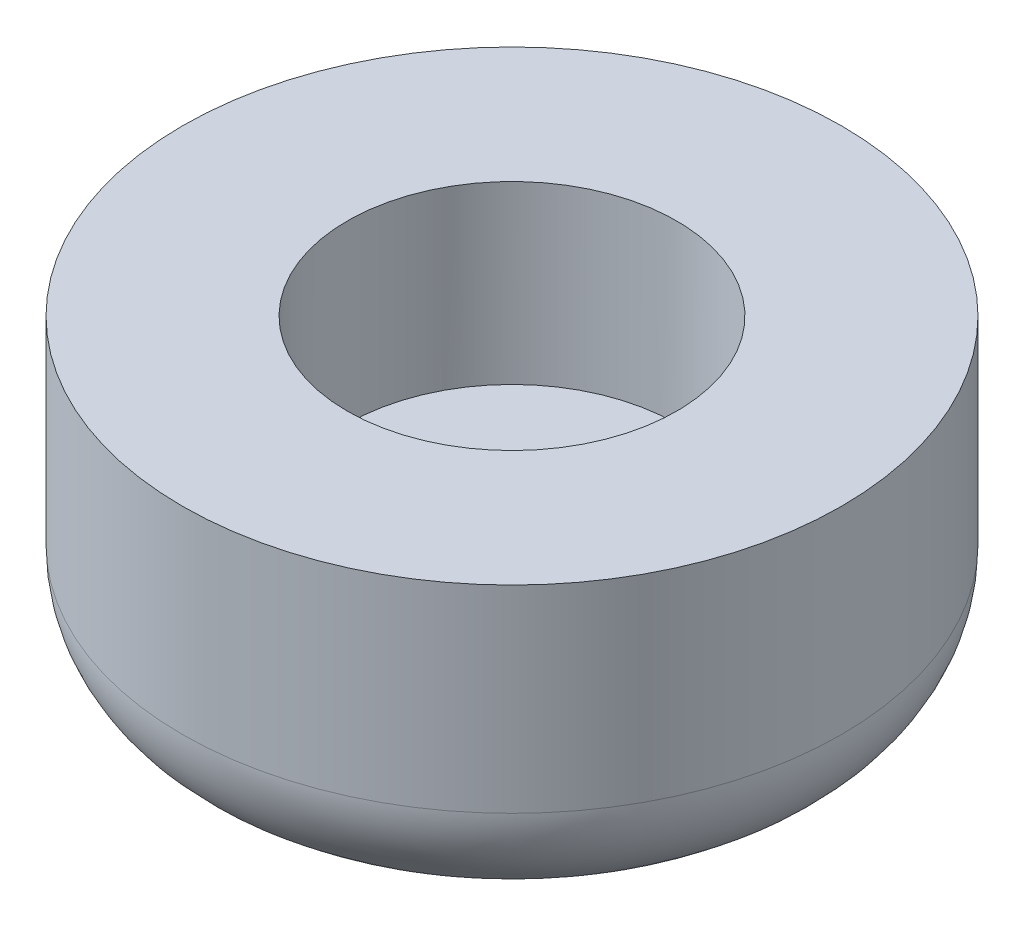
ISO-10303-21;
HEADER;
FILE_DESCRIPTION(('STEP AP214'),'2;1');
FILE_NAME('part.step','',(''),(''),'','','');
FILE_SCHEMA(('AUTOMOTIVE_DESIGN { 1 0 10303 214 1 1 1 1 }'));
ENDSEC;
DATA;
#1=APPLICATION_CONTEXT('core data for automotive mechanical design processes');
#2=APPLICATION_PROTOCOL_DEFINITION('international standard','automotive_design',2000,#1);
#3=PRODUCT_CONTEXT('',#1,'mechanical');
#4=PRODUCT('Part','Part','',(#3));
#5=PRODUCT_RELATED_PRODUCT_CATEGORY('part','',(#4));
#6=PRODUCT_DEFINITION_FORMATION('','',#4);
#7=PRODUCT_DEFINITION_CONTEXT('part definition',#1,'design');
#8=PRODUCT_DEFINITION('design','',#6,#7);
#9=PRODUCT_DEFINITION_SHAPE('','',#8);
#10=(LENGTH_UNIT() NAMED_UNIT(*) SI_UNIT(.MILLI.,.METRE.));
#11=(NAMED_UNIT(*) PLANE_ANGLE_UNIT() SI_UNIT($,.RADIAN.));
#12=(NAMED_UNIT(*) SI_UNIT($,.STERADIAN.) SOLID_ANGLE_UNIT());
#13=UNCERTAINTY_MEASURE_WITH_UNIT(LENGTH_MEASURE(1.E-05),#10,'distance_accuracy_value','');
#14=(GEOMETRIC_REPRESENTATION_CONTEXT(3) GLOBAL_UNCERTAINTY_ASSIGNED_CONTEXT((#13)) GLOBAL_UNIT_ASSIGNED_CONTEXT((#10,
#11,#12)) REPRESENTATION_CONTEXT('',''));
#15=CARTESIAN_POINT('',(0.,0.,0.));
#16=DIRECTION('',(0.,0.,1.));
#17=DIRECTION('',(1.,0.,0.));
#18=AXIS2_PLACEMENT_3D('',#15,#16,#17);
#19=CARTESIAN_POINT('',(0.,-7.,0.));
#20=DIRECTION('',(0.,1.,0.));
#21=DIRECTION('',(0.,0.,1.));
#22=AXIS2_PLACEMENT_3D('',#19,#20,#21);
#23=CYLINDRICAL_SURFACE('',#22,3.75);
#24=CARTESIAN_POINT('',(0.,0.,0.));
#25=DIRECTION('',(0.,1.,0.));
#26=DIRECTION('',(0.,0.,1.));
#27=AXIS2_PLACEMENT_3D('',#24,#25,#26);
#28=CIRCLE('',#27,3.75);
#29=CARTESIAN_POINT('',(0.,0.,3.75));
#30=VERTEX_POINT('',#29);
#31=EDGE_CURVE('E59',#30,#30,#28,.T.);
#32=ORIENTED_EDGE('',*,*,#31,.T.);
#33=EDGE_LOOP('',(#32));
#34=FACE_BOUND('',#33,.T.);
#35=CARTESIAN_POINT('',(0.,-4.,0.));
#36=DIRECTION('',(0.,-1.,0.));
#37=DIRECTION('',(0.,0.,-1.));
#38=AXIS2_PLACEMENT_3D('',#35,#36,#37);
#39=CIRCLE('',#38,3.75);
#40=CARTESIAN_POINT('',(0.,-4.,-3.75));
#41=VERTEX_POINT('',#40);
#42=EDGE_CURVE('E50',#41,#41,#39,.F.);
#43=ORIENTED_EDGE('',*,*,#42,.F.);
#44=EDGE_LOOP('',(#43));
#45=FACE_BOUND('',#44,.T.);
#46=ADVANCED_FACE('F39',(#34,#45),#23,.F.);
#47=CARTESIAN_POINT('',(0.,-7.,0.));
#48=DIRECTION('',(0.,1.,0.));
#49=DIRECTION('',(0.,0.,1.));
#50=AXIS2_PLACEMENT_3D('',#47,#48,#49);
#51=CYLINDRICAL_SURFACE('',#50,7.5);
#52=CARTESIAN_POINT('',(0.,-4.5,0.));
#53=DIRECTION('',(0.,1.,0.));
#54=DIRECTION('',(0.,0.,1.));
#55=AXIS2_PLACEMENT_3D('',#52,#53,#54);
#56=CIRCLE('',#55,7.5);
#57=CARTESIAN_POINT('',(0.,-4.5,7.5));
#58=VERTEX_POINT('',#57);
#59=EDGE_CURVE('E46',#58,#58,#56,.T.);
#60=ORIENTED_EDGE('',*,*,#59,.T.);
#61=EDGE_LOOP('',(#60));
#62=FACE_BOUND('',#61,.T.);
#63=CARTESIAN_POINT('',(0.,0.,0.));
#64=DIRECTION('',(0.,1.,0.));
#65=DIRECTION('',(0.,0.,1.));
#66=AXIS2_PLACEMENT_3D('',#63,#64,#65);
#67=CIRCLE('',#66,7.5);
#68=CARTESIAN_POINT('',(0.,0.,7.5));
#69=VERTEX_POINT('',#68);
#70=EDGE_CURVE('E54',#69,#69,#67,.T.);
#71=ORIENTED_EDGE('',*,*,#70,.F.);
#72=EDGE_LOOP('',(#71));
#73=FACE_BOUND('',#72,.T.);
#74=ADVANCED_FACE('F73',(#62,#73),#51,.T.);
#75=CARTESIAN_POINT('',(0.,-7.,0.));
#76=DIRECTION('',(0.,1.,0.));
#77=DIRECTION('',(0.,0.,1.));
#78=AXIS2_PLACEMENT_3D('',#75,#76,#77);
#79=PLANE('',#78);
#80=CARTESIAN_POINT('',(0.,-7.,0.));
#81=DIRECTION('',(0.,1.,0.));
#82=DIRECTION('',(0.,0.,1.));
#83=AXIS2_PLACEMENT_3D('',#80,#81,#82);
#84=CIRCLE('',#83,5.);
#85=CARTESIAN_POINT('',(0.,-7.,5.));
#86=VERTEX_POINT('',#85);
#87=EDGE_CURVE('E10',#86,#86,#84,.F.);
#88=ORIENTED_EDGE('',*,*,#87,.T.);
#89=EDGE_LOOP('',(#88));
#90=FACE_BOUND('',#89,.T.);
#91=ADVANCED_FACE('F69',(#90),#79,.F.);
#92=CARTESIAN_POINT('',(0.,0.,0.));
#93=DIRECTION('',(0.,1.,0.));
#94=DIRECTION('',(0.,0.,1.));
#95=AXIS2_PLACEMENT_3D('',#92,#93,#94);
#96=PLANE('',#95);
#97=ORIENTED_EDGE('',*,*,#31,.F.);
#98=EDGE_LOOP('',(#97));
#99=FACE_BOUND('',#98,.T.);
#100=ORIENTED_EDGE('',*,*,#70,.T.);
#101=EDGE_LOOP('',(#100));
#102=FACE_BOUND('',#101,.T.);
#103=ADVANCED_FACE('F65',(#99,#102),#96,.T.);
#104=CARTESIAN_POINT('',(0.,-4.,0.));
#105=DIRECTION('',(0.,-1.,0.));
#106=DIRECTION('',(0.,0.,-1.));
#107=AXIS2_PLACEMENT_3D('',#104,#105,#106);
#108=PLANE('',#107);
#109=ORIENTED_EDGE('',*,*,#42,.T.);
#110=EDGE_LOOP('',(#109));
#111=FACE_BOUND('',#110,.T.);
#112=ADVANCED_FACE('F68',(#111),#108,.F.);
#113=CARTESIAN_POINT('',(0.,-4.5,0.));
#114=DIRECTION('',(0.,1.,0.));
#115=DIRECTION('',(0.,0.,1.));
#116=AXIS2_PLACEMENT_3D('',#113,#114,#115);
#117=TOROIDAL_SURFACE('',#116,5.,2.5);
#118=ORIENTED_EDGE('',*,*,#87,.F.);
#119=EDGE_LOOP('',(#118));
#120=FACE_BOUND('',#119,.T.);
#121=ORIENTED_EDGE('',*,*,#59,.F.);
#122=EDGE_LOOP('',(#121));
#123=FACE_BOUND('',#122,.T.);
#124=ADVANCED_FACE('F41',(#120,#123),#117,.T.);
#125=CLOSED_SHELL('',(#46,#74,#91,#103,#112,#124));
#126=MANIFOLD_SOLID_BREP('B2',#125);
#127=ADVANCED_BREP_SHAPE_REPRESENTATION('',(#18,#126),#14);
#128=SHAPE_DEFINITION_REPRESENTATION(#9,#127);
ENDSEC;
END-ISO-10303-21;
